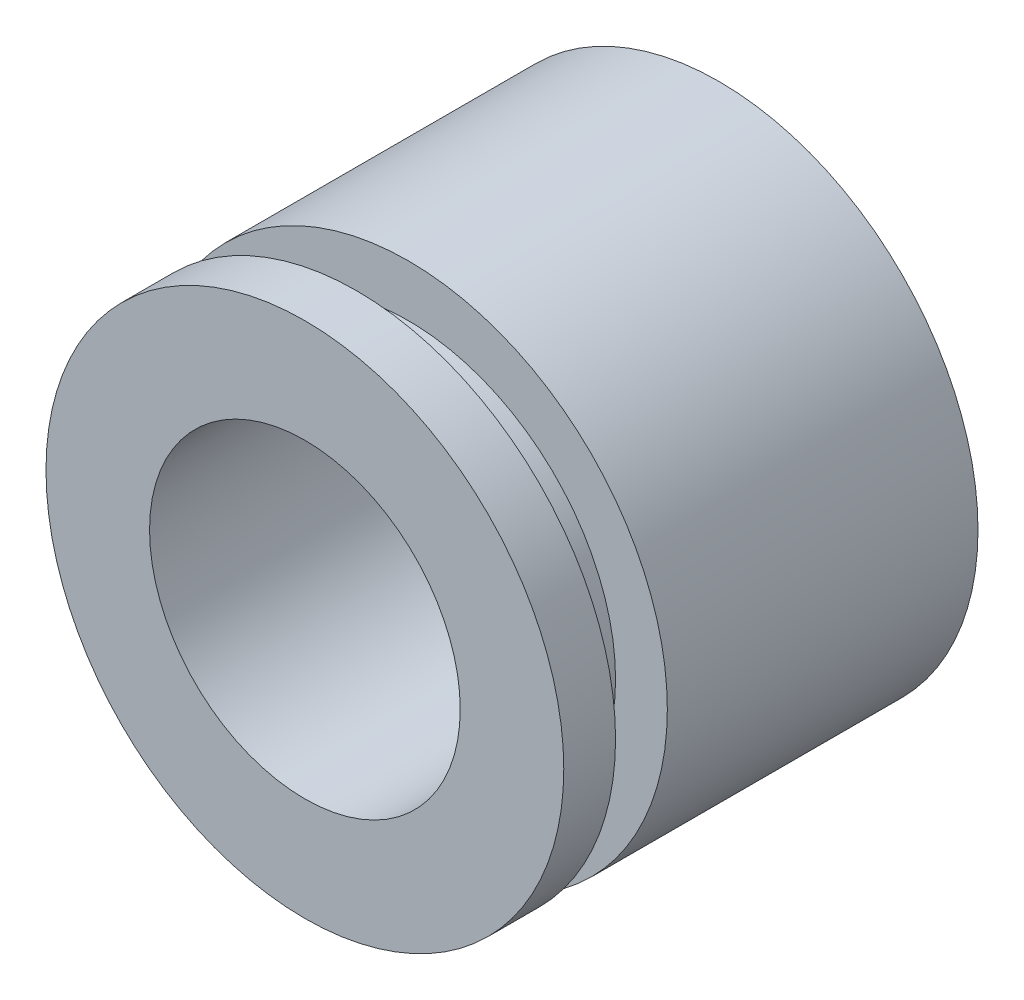
ISO-10303-21;
HEADER;
FILE_DESCRIPTION(('STEP AP214'),'2;1');
FILE_NAME('part.step','',(''),(''),'','','');
FILE_SCHEMA(('AUTOMOTIVE_DESIGN { 1 0 10303 214 1 1 1 1 }'));
ENDSEC;
DATA;
#1=APPLICATION_CONTEXT('core data for automotive mechanical design processes');
#2=APPLICATION_PROTOCOL_DEFINITION('international standard','automotive_design',2000,#1);
#3=PRODUCT_CONTEXT('',#1,'mechanical');
#4=PRODUCT('Part','Part','',(#3));
#5=PRODUCT_RELATED_PRODUCT_CATEGORY('part','',(#4));
#6=PRODUCT_DEFINITION_FORMATION('','',#4);
#7=PRODUCT_DEFINITION_CONTEXT('part definition',#1,'design');
#8=PRODUCT_DEFINITION('design','',#6,#7);
#9=PRODUCT_DEFINITION_SHAPE('','',#8);
#10=(LENGTH_UNIT() NAMED_UNIT(*) SI_UNIT(.MILLI.,.METRE.));
#11=(NAMED_UNIT(*) PLANE_ANGLE_UNIT() SI_UNIT($,.RADIAN.));
#12=(NAMED_UNIT(*) SI_UNIT($,.STERADIAN.) SOLID_ANGLE_UNIT());
#13=UNCERTAINTY_MEASURE_WITH_UNIT(LENGTH_MEASURE(1.E-05),#10,'distance_accuracy_value','');
#14=(GEOMETRIC_REPRESENTATION_CONTEXT(3) GLOBAL_UNCERTAINTY_ASSIGNED_CONTEXT((#13)) GLOBAL_UNIT_ASSIGNED_CONTEXT((#10,
#11,#12)) REPRESENTATION_CONTEXT('',''));
#15=CARTESIAN_POINT('',(0.,0.,0.));
#16=DIRECTION('',(0.,0.,1.));
#17=DIRECTION('',(1.,0.,0.));
#18=AXIS2_PLACEMENT_3D('',#15,#16,#17);
#19=CARTESIAN_POINT('',(0.,0.,76.2));
#20=DIRECTION('',(0.,0.,-1.));
#21=DIRECTION('',(-1.,0.,0.));
#22=AXIS2_PLACEMENT_3D('',#19,#20,#21);
#23=CYLINDRICAL_SURFACE('',#22,63.5);
#24=CARTESIAN_POINT('',(0.,0.,76.2));
#25=DIRECTION('',(0.,0.,1.));
#26=DIRECTION('',(1.,0.,0.));
#27=AXIS2_PLACEMENT_3D('',#24,#25,#26);
#28=CIRCLE('',#27,63.5);
#29=CARTESIAN_POINT('',(63.5,0.,76.2));
#30=VERTEX_POINT('',#29);
#31=EDGE_CURVE('E10',#30,#30,#28,.T.);
#32=ORIENTED_EDGE('',*,*,#31,.F.);
#33=EDGE_LOOP('',(#32));
#34=FACE_BOUND('',#33,.T.);
#35=CARTESIAN_POINT('',(0.,0.,0.));
#36=DIRECTION('',(0.,0.,1.));
#37=DIRECTION('',(1.,0.,0.));
#38=AXIS2_PLACEMENT_3D('',#35,#36,#37);
#39=CIRCLE('',#38,63.5);
#40=CARTESIAN_POINT('',(63.5,0.,0.));
#41=VERTEX_POINT('',#40);
#42=EDGE_CURVE('E34',#41,#41,#39,.T.);
#43=ORIENTED_EDGE('',*,*,#42,.T.);
#44=EDGE_LOOP('',(#43));
#45=FACE_BOUND('',#44,.T.);
#46=ADVANCED_FACE('F31',(#34,#45),#23,.T.);
#47=CARTESIAN_POINT('',(0.,0.,76.2));
#48=DIRECTION('',(0.,0.,1.));
#49=DIRECTION('',(1.,0.,0.));
#50=AXIS2_PLACEMENT_3D('',#47,#48,#49);
#51=PLANE('',#50);
#52=CARTESIAN_POINT('',(0.,0.,76.2));
#53=DIRECTION('',(0.,0.,1.));
#54=DIRECTION('',(1.,0.,0.));
#55=AXIS2_PLACEMENT_3D('',#52,#53,#54);
#56=CIRCLE('',#55,50.8);
#57=CARTESIAN_POINT('',(50.8,0.,76.2));
#58=VERTEX_POINT('',#57);
#59=EDGE_CURVE('E43',#58,#58,#56,.T.);
#60=ORIENTED_EDGE('',*,*,#59,.F.);
#61=EDGE_LOOP('',(#60));
#62=FACE_BOUND('',#61,.T.);
#63=ORIENTED_EDGE('',*,*,#31,.T.);
#64=EDGE_LOOP('',(#63));
#65=FACE_BOUND('',#64,.T.);
#66=ADVANCED_FACE('F75',(#62,#65),#51,.T.);
#67=CARTESIAN_POINT('',(0.,0.,0.));
#68=DIRECTION('',(0.,0.,1.));
#69=DIRECTION('',(1.,0.,0.));
#70=AXIS2_PLACEMENT_3D('',#67,#68,#69);
#71=PLANE('',#70);
#72=CARTESIAN_POINT('',(0.,0.,0.));
#73=DIRECTION('',(0.,0.,-1.));
#74=DIRECTION('',(-1.,0.,0.));
#75=AXIS2_PLACEMENT_3D('',#72,#73,#74);
#76=CIRCLE('',#75,38.1);
#77=CARTESIAN_POINT('',(-38.1,0.,0.));
#78=VERTEX_POINT('',#77);
#79=EDGE_CURVE('E55',#78,#78,#76,.T.);
#80=ORIENTED_EDGE('',*,*,#79,.F.);
#81=EDGE_LOOP('',(#80));
#82=FACE_BOUND('',#81,.T.);
#83=ORIENTED_EDGE('',*,*,#42,.F.);
#84=EDGE_LOOP('',(#83));
#85=FACE_BOUND('',#84,.T.);
#86=ADVANCED_FACE('F71',(#82,#85),#71,.F.);
#87=CARTESIAN_POINT('',(0.,0.,88.9));
#88=DIRECTION('',(0.,0.,-1.));
#89=DIRECTION('',(-1.,0.,0.));
#90=AXIS2_PLACEMENT_3D('',#87,#88,#89);
#91=CYLINDRICAL_SURFACE('',#90,50.8);
#92=CARTESIAN_POINT('',(0.,0.,88.9));
#93=DIRECTION('',(0.,0.,1.));
#94=DIRECTION('',(1.,0.,0.));
#95=AXIS2_PLACEMENT_3D('',#92,#93,#94);
#96=CIRCLE('',#95,50.8);
#97=CARTESIAN_POINT('',(50.8,0.,88.9));
#98=VERTEX_POINT('',#97);
#99=EDGE_CURVE('E41',#98,#98,#96,.T.);
#100=ORIENTED_EDGE('',*,*,#99,.F.);
#101=EDGE_LOOP('',(#100));
#102=FACE_BOUND('',#101,.T.);
#103=ORIENTED_EDGE('',*,*,#59,.T.);
#104=EDGE_LOOP('',(#103));
#105=FACE_BOUND('',#104,.T.);
#106=ADVANCED_FACE('F74',(#102,#105),#91,.T.);
#107=CARTESIAN_POINT('',(0.,0.,101.6));
#108=DIRECTION('',(0.,0.,-1.));
#109=DIRECTION('',(-1.,0.,0.));
#110=AXIS2_PLACEMENT_3D('',#107,#108,#109);
#111=CYLINDRICAL_SURFACE('',#110,63.5);
#112=CARTESIAN_POINT('',(0.,0.,101.6));
#113=DIRECTION('',(0.,0.,1.));
#114=DIRECTION('',(1.,0.,0.));
#115=AXIS2_PLACEMENT_3D('',#112,#113,#114);
#116=CIRCLE('',#115,63.5);
#117=CARTESIAN_POINT('',(63.5,0.,101.6));
#118=VERTEX_POINT('',#117);
#119=EDGE_CURVE('E46',#118,#118,#116,.T.);
#120=ORIENTED_EDGE('',*,*,#119,.F.);
#121=EDGE_LOOP('',(#120));
#122=FACE_BOUND('',#121,.T.);
#123=CARTESIAN_POINT('',(0.,0.,88.9));
#124=DIRECTION('',(0.,0.,1.));
#125=DIRECTION('',(1.,0.,0.));
#126=AXIS2_PLACEMENT_3D('',#123,#124,#125);
#127=CIRCLE('',#126,63.5);
#128=CARTESIAN_POINT('',(63.5,0.,88.9));
#129=VERTEX_POINT('',#128);
#130=EDGE_CURVE('E49',#129,#129,#127,.T.);
#131=ORIENTED_EDGE('',*,*,#130,.T.);
#132=EDGE_LOOP('',(#131));
#133=FACE_BOUND('',#132,.T.);
#134=ADVANCED_FACE('F91',(#122,#133),#111,.T.);
#135=CARTESIAN_POINT('',(0.,0.,101.6));
#136=DIRECTION('',(0.,0.,1.));
#137=DIRECTION('',(1.,0.,0.));
#138=AXIS2_PLACEMENT_3D('',#135,#136,#137);
#139=PLANE('',#138);
#140=CARTESIAN_POINT('',(0.,0.,101.6));
#141=DIRECTION('',(0.,0.,-1.));
#142=DIRECTION('',(-1.,0.,0.));
#143=AXIS2_PLACEMENT_3D('',#140,#141,#142);
#144=CIRCLE('',#143,38.1);
#145=CARTESIAN_POINT('',(-38.1,0.,101.6));
#146=VERTEX_POINT('',#145);
#147=EDGE_CURVE('E52',#146,#146,#144,.T.);
#148=ORIENTED_EDGE('',*,*,#147,.T.);
#149=EDGE_LOOP('',(#148));
#150=FACE_BOUND('',#149,.T.);
#151=ORIENTED_EDGE('',*,*,#119,.T.);
#152=EDGE_LOOP('',(#151));
#153=FACE_BOUND('',#152,.T.);
#154=ADVANCED_FACE('F61',(#150,#153),#139,.T.);
#155=CARTESIAN_POINT('',(0.,0.,88.9));
#156=DIRECTION('',(0.,0.,1.));
#157=DIRECTION('',(1.,0.,0.));
#158=AXIS2_PLACEMENT_3D('',#155,#156,#157);
#159=PLANE('',#158);
#160=ORIENTED_EDGE('',*,*,#99,.T.);
#161=EDGE_LOOP('',(#160));
#162=FACE_BOUND('',#161,.T.);
#163=ORIENTED_EDGE('',*,*,#130,.F.);
#164=EDGE_LOOP('',(#163));
#165=FACE_BOUND('',#164,.T.);
#166=ADVANCED_FACE('F67',(#162,#165),#159,.F.);
#167=CARTESIAN_POINT('',(0.,0.,101.6));
#168=DIRECTION('',(0.,0.,-1.));
#169=DIRECTION('',(-1.,0.,0.));
#170=AXIS2_PLACEMENT_3D('',#167,#168,#169);
#171=CYLINDRICAL_SURFACE('',#170,38.1);
#172=ORIENTED_EDGE('',*,*,#147,.F.);
#173=EDGE_LOOP('',(#172));
#174=FACE_BOUND('',#173,.T.);
#175=ORIENTED_EDGE('',*,*,#79,.T.);
#176=EDGE_LOOP('',(#175));
#177=FACE_BOUND('',#176,.T.);
#178=ADVANCED_FACE('F64',(#174,#177),#171,.F.);
#179=CLOSED_SHELL('',(#46,#66,#86,#106,#134,#154,#166,#178));
#180=MANIFOLD_SOLID_BREP('B2',#179);
#181=ADVANCED_BREP_SHAPE_REPRESENTATION('',(#18,#180),#14);
#182=SHAPE_DEFINITION_REPRESENTATION(#9,#181);
ENDSEC;
END-ISO-10303-21;
